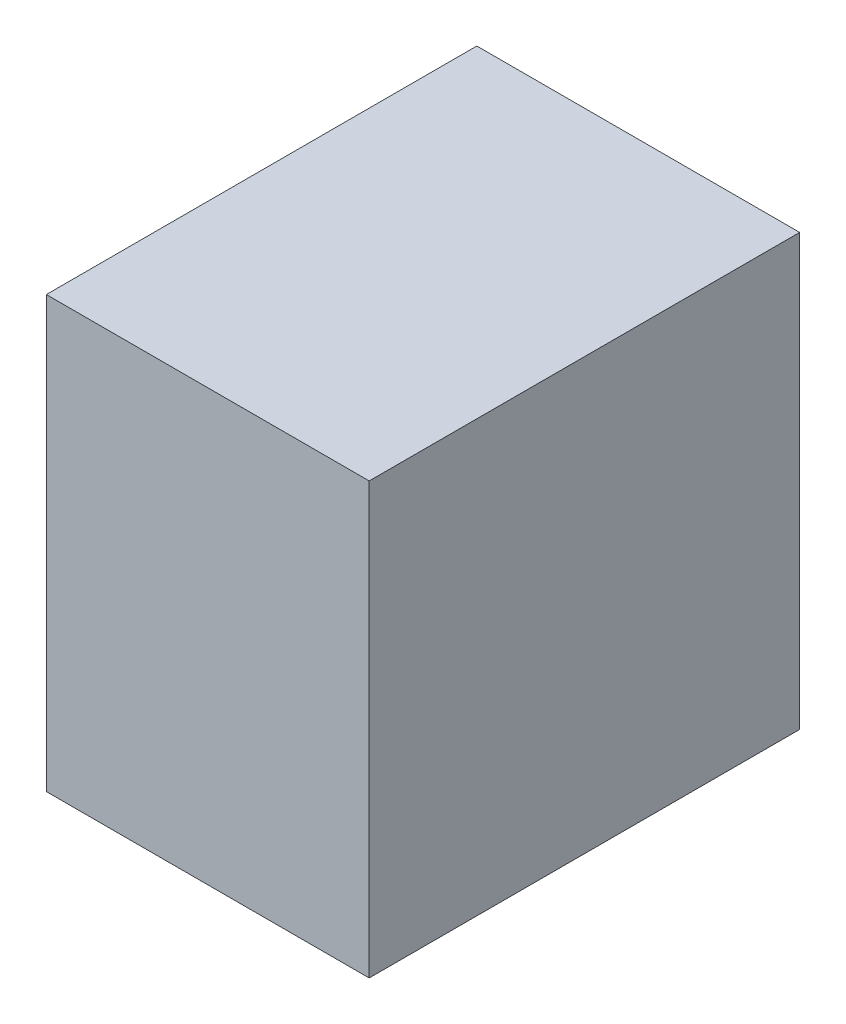
ISO-10303-21;
HEADER;
FILE_DESCRIPTION(('STEP AP214'),'2;1');
FILE_NAME('part.step','',(''),(''),'','','');
FILE_SCHEMA(('AUTOMOTIVE_DESIGN { 1 0 10303 214 1 1 1 1 }'));
ENDSEC;
DATA;
#1=APPLICATION_CONTEXT('core data for automotive mechanical design processes');
#2=APPLICATION_PROTOCOL_DEFINITION('international standard','automotive_design',2000,#1);
#3=PRODUCT_CONTEXT('',#1,'mechanical');
#4=PRODUCT('Part','Part','',(#3));
#5=PRODUCT_RELATED_PRODUCT_CATEGORY('part','',(#4));
#6=PRODUCT_DEFINITION_FORMATION('','',#4);
#7=PRODUCT_DEFINITION_CONTEXT('part definition',#1,'design');
#8=PRODUCT_DEFINITION('design','',#6,#7);
#9=PRODUCT_DEFINITION_SHAPE('','',#8);
#10=(LENGTH_UNIT() NAMED_UNIT(*) SI_UNIT(.MILLI.,.METRE.));
#11=(NAMED_UNIT(*) PLANE_ANGLE_UNIT() SI_UNIT($,.RADIAN.));
#12=(NAMED_UNIT(*) SI_UNIT($,.STERADIAN.) SOLID_ANGLE_UNIT());
#13=UNCERTAINTY_MEASURE_WITH_UNIT(LENGTH_MEASURE(1.E-05),#10,'distance_accuracy_value','');
#14=(GEOMETRIC_REPRESENTATION_CONTEXT(3) GLOBAL_UNCERTAINTY_ASSIGNED_CONTEXT((#13)) GLOBAL_UNIT_ASSIGNED_CONTEXT((#10,
#11,#12)) REPRESENTATION_CONTEXT('',''));
#15=CARTESIAN_POINT('',(0.,0.,0.));
#16=DIRECTION('',(0.,0.,1.));
#17=DIRECTION('',(1.,0.,0.));
#18=AXIS2_PLACEMENT_3D('',#15,#16,#17);
#19=CARTESIAN_POINT('',(-38.1,-50.8,50.8));
#20=DIRECTION('',(0.,0.,1.));
#21=DIRECTION('',(1.,0.,0.));
#22=AXIS2_PLACEMENT_3D('',#19,#20,#21);
#23=PLANE('',#22);
#24=DIRECTION('',(1.,0.,0.));
#25=VECTOR('',#24,1.);
#26=CARTESIAN_POINT('',(-38.1,-50.8,50.8));
#27=LINE('',#26,#25);
#28=CARTESIAN_POINT('',(-38.1,-50.8,50.8));
#29=VERTEX_POINT('',#28);
#30=CARTESIAN_POINT('',(38.1,-50.8,50.8));
#31=VERTEX_POINT('',#30);
#32=EDGE_CURVE('E36',#29,#31,#27,.T.);
#33=ORIENTED_EDGE('',*,*,#32,.T.);
#34=DIRECTION('',(0.,-1.,0.));
#35=VECTOR('',#34,1.);
#36=CARTESIAN_POINT('',(38.1,-50.8,50.8));
#37=LINE('',#36,#35);
#38=CARTESIAN_POINT('',(38.1,50.8,50.8));
#39=VERTEX_POINT('',#38);
#40=EDGE_CURVE('E73',#39,#31,#37,.T.);
#41=ORIENTED_EDGE('',*,*,#40,.F.);
#42=DIRECTION('',(1.,0.,0.));
#43=VECTOR('',#42,1.);
#44=CARTESIAN_POINT('',(-38.1,50.8,50.8));
#45=LINE('',#44,#43);
#46=CARTESIAN_POINT('',(-38.1,50.8,50.8));
#47=VERTEX_POINT('',#46);
#48=EDGE_CURVE('E11',#47,#39,#45,.T.);
#49=ORIENTED_EDGE('',*,*,#48,.F.);
#50=DIRECTION('',(0.,-1.,0.));
#51=VECTOR('',#50,1.);
#52=CARTESIAN_POINT('',(-38.1,-50.8,50.8));
#53=LINE('',#52,#51);
#54=EDGE_CURVE('E74',#47,#29,#53,.T.);
#55=ORIENTED_EDGE('',*,*,#54,.T.);
#56=EDGE_LOOP('',(#33,#41,#49,#55));
#57=FACE_BOUND('',#56,.T.);
#58=ADVANCED_FACE('F33',(#57),#23,.T.);
#59=CARTESIAN_POINT('',(-38.1,50.8,-50.8));
#60=DIRECTION('',(0.,1.,0.));
#61=DIRECTION('',(0.,0.,1.));
#62=AXIS2_PLACEMENT_3D('',#59,#60,#61);
#63=PLANE('',#62);
#64=ORIENTED_EDGE('',*,*,#48,.T.);
#65=DIRECTION('',(0.,0.,1.));
#66=VECTOR('',#65,1.);
#67=CARTESIAN_POINT('',(38.1,50.8,-50.8));
#68=LINE('',#67,#66);
#69=CARTESIAN_POINT('',(38.1,50.8,-50.8));
#70=VERTEX_POINT('',#69);
#71=EDGE_CURVE('E90',#70,#39,#68,.T.);
#72=ORIENTED_EDGE('',*,*,#71,.F.);
#73=DIRECTION('',(1.,0.,0.));
#74=VECTOR('',#73,1.);
#75=CARTESIAN_POINT('',(-38.1,50.8,-50.8));
#76=LINE('',#75,#74);
#77=CARTESIAN_POINT('',(-38.1,50.8,-50.8));
#78=VERTEX_POINT('',#77);
#79=EDGE_CURVE('E41',#78,#70,#76,.T.);
#80=ORIENTED_EDGE('',*,*,#79,.F.);
#81=DIRECTION('',(0.,0.,1.));
#82=VECTOR('',#81,1.);
#83=CARTESIAN_POINT('',(-38.1,50.8,-50.8));
#84=LINE('',#83,#82);
#85=EDGE_CURVE('E79',#78,#47,#84,.T.);
#86=ORIENTED_EDGE('',*,*,#85,.T.);
#87=EDGE_LOOP('',(#64,#72,#80,#86));
#88=FACE_BOUND('',#87,.T.);
#89=ADVANCED_FACE('F105',(#88),#63,.T.);
#90=CARTESIAN_POINT('',(-38.1,-50.8,-50.8));
#91=DIRECTION('',(0.,0.,-1.));
#92=DIRECTION('',(-1.,0.,0.));
#93=AXIS2_PLACEMENT_3D('',#90,#91,#92);
#94=PLANE('',#93);
#95=ORIENTED_EDGE('',*,*,#79,.T.);
#96=DIRECTION('',(0.,1.,0.));
#97=VECTOR('',#96,1.);
#98=CARTESIAN_POINT('',(38.1,-50.8,-50.8));
#99=LINE('',#98,#97);
#100=CARTESIAN_POINT('',(38.1,-50.8,-50.8));
#101=VERTEX_POINT('',#100);
#102=EDGE_CURVE('E86',#101,#70,#99,.T.);
#103=ORIENTED_EDGE('',*,*,#102,.F.);
#104=DIRECTION('',(1.,0.,0.));
#105=VECTOR('',#104,1.);
#106=CARTESIAN_POINT('',(-38.1,-50.8,-50.8));
#107=LINE('',#106,#105);
#108=CARTESIAN_POINT('',(-38.1,-50.8,-50.8));
#109=VERTEX_POINT('',#108);
#110=EDGE_CURVE('E78',#109,#101,#107,.T.);
#111=ORIENTED_EDGE('',*,*,#110,.F.);
#112=DIRECTION('',(0.,1.,0.));
#113=VECTOR('',#112,1.);
#114=CARTESIAN_POINT('',(-38.1,-50.8,-50.8));
#115=LINE('',#114,#113);
#116=EDGE_CURVE('E98',#109,#78,#115,.T.);
#117=ORIENTED_EDGE('',*,*,#116,.T.);
#118=EDGE_LOOP('',(#95,#103,#111,#117));
#119=FACE_BOUND('',#118,.T.);
#120=ADVANCED_FACE('F102',(#119),#94,.T.);
#121=CARTESIAN_POINT('',(-38.1,-50.8,-50.8));
#122=DIRECTION('',(0.,-1.,0.));
#123=DIRECTION('',(0.,0.,-1.));
#124=AXIS2_PLACEMENT_3D('',#121,#122,#123);
#125=PLANE('',#124);
#126=ORIENTED_EDGE('',*,*,#110,.T.);
#127=DIRECTION('',(0.,0.,-1.));
#128=VECTOR('',#127,1.);
#129=CARTESIAN_POINT('',(38.1,-50.8,-50.8));
#130=LINE('',#129,#128);
#131=EDGE_CURVE('E81',#31,#101,#130,.T.);
#132=ORIENTED_EDGE('',*,*,#131,.F.);
#133=ORIENTED_EDGE('',*,*,#32,.F.);
#134=DIRECTION('',(0.,0.,-1.));
#135=VECTOR('',#134,1.);
#136=CARTESIAN_POINT('',(-38.1,-50.8,-50.8));
#137=LINE('',#136,#135);
#138=EDGE_CURVE('E96',#29,#109,#137,.T.);
#139=ORIENTED_EDGE('',*,*,#138,.T.);
#140=EDGE_LOOP('',(#126,#132,#133,#139));
#141=FACE_BOUND('',#140,.T.);
#142=ADVANCED_FACE('F82',(#141),#125,.T.);
#143=CARTESIAN_POINT('',(-38.1,0.,0.));
#144=DIRECTION('',(1.,0.,0.));
#145=DIRECTION('',(0.,0.,-1.));
#146=AXIS2_PLACEMENT_3D('',#143,#144,#145);
#147=PLANE('',#146);
#148=ORIENTED_EDGE('',*,*,#54,.F.);
#149=ORIENTED_EDGE('',*,*,#85,.F.);
#150=ORIENTED_EDGE('',*,*,#116,.F.);
#151=ORIENTED_EDGE('',*,*,#138,.F.);
#152=EDGE_LOOP('',(#148,#149,#150,#151));
#153=FACE_BOUND('',#152,.T.);
#154=ADVANCED_FACE('F107',(#153),#147,.F.);
#155=CARTESIAN_POINT('',(38.1,0.,0.));
#156=DIRECTION('',(1.,0.,0.));
#157=DIRECTION('',(0.,0.,-1.));
#158=AXIS2_PLACEMENT_3D('',#155,#156,#157);
#159=PLANE('',#158);
#160=ORIENTED_EDGE('',*,*,#40,.T.);
#161=ORIENTED_EDGE('',*,*,#131,.T.);
#162=ORIENTED_EDGE('',*,*,#102,.T.);
#163=ORIENTED_EDGE('',*,*,#71,.T.);
#164=EDGE_LOOP('',(#160,#161,#162,#163));
#165=FACE_BOUND('',#164,.T.);
#166=ADVANCED_FACE('F89',(#165),#159,.T.);
#167=CLOSED_SHELL('',(#58,#89,#120,#142,#154,#166));
#168=MANIFOLD_SOLID_BREP('B2',#167);
#169=ADVANCED_BREP_SHAPE_REPRESENTATION('',(#18,#168),#14);
#170=SHAPE_DEFINITION_REPRESENTATION(#9,#169);
ENDSEC;
END-ISO-10303-21;
